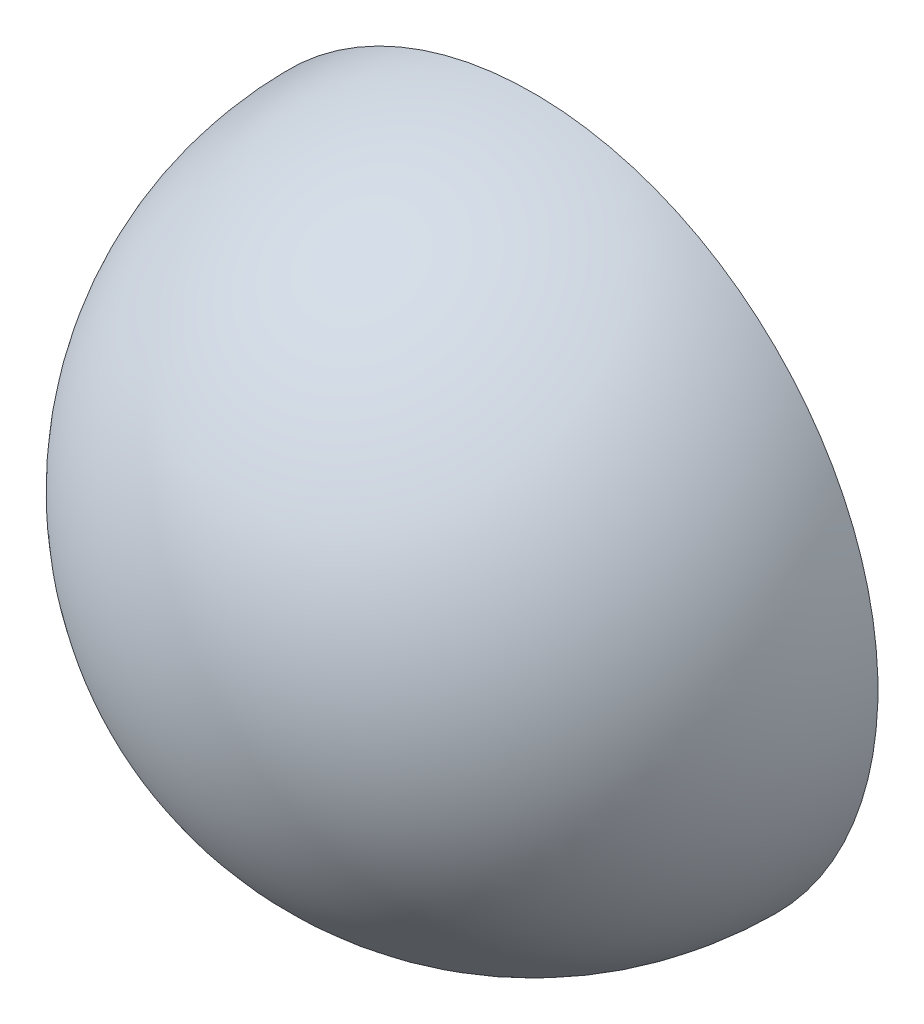
ISO-10303-21;
HEADER;
FILE_DESCRIPTION(('STEP AP214'),'2;1');
FILE_NAME('part.step','',(''),(''),'','','');
FILE_SCHEMA(('AUTOMOTIVE_DESIGN { 1 0 10303 214 1 1 1 1 }'));
ENDSEC;
DATA;
#1=APPLICATION_CONTEXT('core data for automotive mechanical design processes');
#2=APPLICATION_PROTOCOL_DEFINITION('international standard','automotive_design',2000,#1);
#3=PRODUCT_CONTEXT('',#1,'mechanical');
#4=PRODUCT('Part','Part','',(#3));
#5=PRODUCT_RELATED_PRODUCT_CATEGORY('part','',(#4));
#6=PRODUCT_DEFINITION_FORMATION('','',#4);
#7=PRODUCT_DEFINITION_CONTEXT('part definition',#1,'design');
#8=PRODUCT_DEFINITION('design','',#6,#7);
#9=PRODUCT_DEFINITION_SHAPE('','',#8);
#10=(LENGTH_UNIT() NAMED_UNIT(*) SI_UNIT(.MILLI.,.METRE.));
#11=(NAMED_UNIT(*) PLANE_ANGLE_UNIT() SI_UNIT($,.RADIAN.));
#12=(NAMED_UNIT(*) SI_UNIT($,.STERADIAN.) SOLID_ANGLE_UNIT());
#13=UNCERTAINTY_MEASURE_WITH_UNIT(LENGTH_MEASURE(1.E-05),#10,'distance_accuracy_value','');
#14=(GEOMETRIC_REPRESENTATION_CONTEXT(3) GLOBAL_UNCERTAINTY_ASSIGNED_CONTEXT((#13)) GLOBAL_UNIT_ASSIGNED_CONTEXT((#10,
#11,#12)) REPRESENTATION_CONTEXT('',''));
#15=CARTESIAN_POINT('',(0.,0.,0.));
#16=DIRECTION('',(0.,0.,1.));
#17=DIRECTION('',(1.,0.,0.));
#18=AXIS2_PLACEMENT_3D('',#15,#16,#17);
#19=CARTESIAN_POINT('',(-50.,0.,0.));
#20=DIRECTION('',(-1.,0.,0.));
#21=DIRECTION('',(0.,1.,0.));
#22=AXIS2_PLACEMENT_3D('',#19,#20,#21);
#23=SPHERICAL_SURFACE('',#22,50.);
#24=CARTESIAN_POINT('',(-50.,0.,0.));
#25=DIRECTION('',(0.,0.,-1.));
#26=DIRECTION('',(-1.,0.,0.));
#27=AXIS2_PLACEMENT_3D('',#24,#25,#26);
#28=SPHERICAL_SURFACE('',#27,50.);
#29=CARTESIAN_POINT('',(-50.,0.,0.));
#30=DIRECTION('',(0.,0.,-1.));
#31=DIRECTION('',(-1.,0.,0.));
#32=AXIS2_PLACEMENT_3D('',#29,#30,#31);
#33=CIRCLE('',#32,50.);
#34=CARTESIAN_POINT('',(-100.,0.,0.));
#35=VERTEX_POINT('',#34);
#36=EDGE_CURVE('E49',#35,#35,#33,.T.);
#37=ORIENTED_EDGE('',*,*,#36,.F.);
#38=EDGE_LOOP('',(#37));
#39=FACE_BOUND('',#38,.T.);
#40=ADVANCED_FACE('F41',(#39),#28,.T.);
#41=CARTESIAN_POINT('',(-50.,0.,0.));
#42=DIRECTION('',(-1.,0.,0.));
#43=DIRECTION('',(0.,-1.,0.));
#44=AXIS2_PLACEMENT_3D('',#41,#42,#43);
#45=SPHERICAL_SURFACE('',#44,48.);
#46=CARTESIAN_POINT('',(-50.,0.,0.));
#47=DIRECTION('',(0.,0.,1.));
#48=DIRECTION('',(-1.,0.,0.));
#49=AXIS2_PLACEMENT_3D('',#46,#47,#48);
#50=SPHERICAL_SURFACE('',#49,48.);
#51=CARTESIAN_POINT('',(-50.,0.,0.));
#52=DIRECTION('',(0.,0.,1.));
#53=DIRECTION('',(-1.,0.,0.));
#54=AXIS2_PLACEMENT_3D('',#51,#52,#53);
#55=CIRCLE('',#54,48.);
#56=CARTESIAN_POINT('',(-98.,0.,0.));
#57=VERTEX_POINT('',#56);
#58=EDGE_CURVE('E10',#57,#57,#55,.T.);
#59=ORIENTED_EDGE('',*,*,#58,.F.);
#60=EDGE_LOOP('',(#59));
#61=FACE_BOUND('',#60,.T.);
#62=ADVANCED_FACE('F43',(#61),#50,.F.);
#63=CARTESIAN_POINT('',(-50.,0.,0.));
#64=DIRECTION('',(0.,0.,1.));
#65=DIRECTION('',(-1.,0.,0.));
#66=AXIS2_PLACEMENT_3D('',#63,#64,#65);
#67=PLANE('',#66);
#68=ORIENTED_EDGE('',*,*,#58,.T.);
#69=EDGE_LOOP('',(#68));
#70=FACE_BOUND('',#69,.T.);
#71=ORIENTED_EDGE('',*,*,#36,.T.);
#72=EDGE_LOOP('',(#71));
#73=FACE_BOUND('',#72,.T.);
#74=ADVANCED_FACE('F56',(#70,#73),#67,.F.);
#75=CLOSED_SHELL('',(#40,#62,#74));
#76=MANIFOLD_SOLID_BREP('B2',#75);
#77=ADVANCED_BREP_SHAPE_REPRESENTATION('',(#18,#76),#14);
#78=SHAPE_DEFINITION_REPRESENTATION(#9,#77);
ENDSEC;
END-ISO-10303-21;
